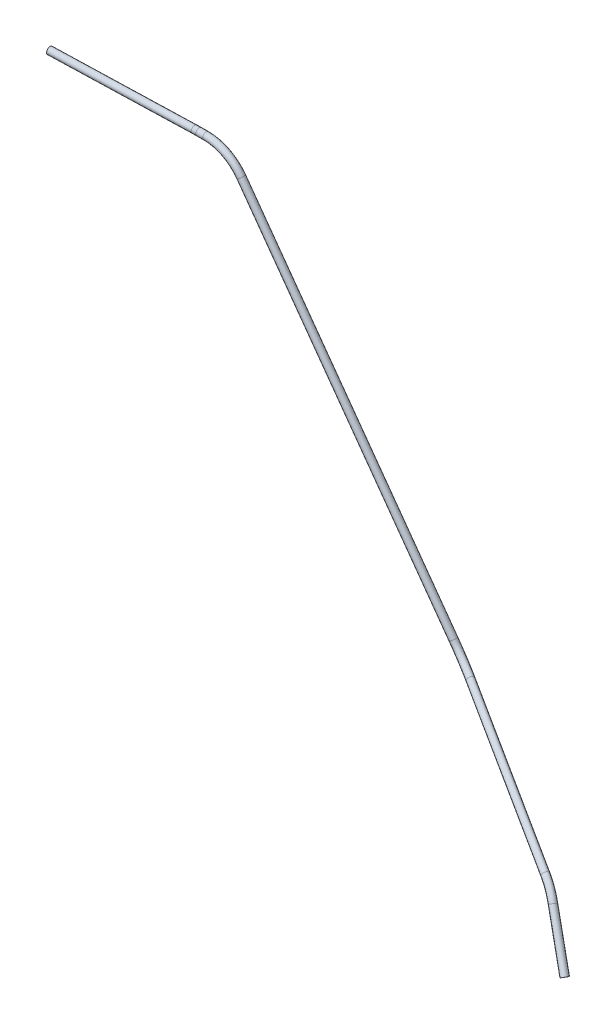
ISO-10303-21;
HEADER;
FILE_DESCRIPTION(('STEP AP214'),'2;1');
FILE_NAME('part.step','',(''),(''),'','','');
FILE_SCHEMA(('AUTOMOTIVE_DESIGN { 1 0 10303 214 1 1 1 1 }'));
ENDSEC;
DATA;
#1=APPLICATION_CONTEXT('core data for automotive mechanical design processes');
#2=APPLICATION_PROTOCOL_DEFINITION('international standard','automotive_design',2000,#1);
#3=PRODUCT_CONTEXT('',#1,'mechanical');
#4=PRODUCT('Part','Part','',(#3));
#5=PRODUCT_RELATED_PRODUCT_CATEGORY('part','',(#4));
#6=PRODUCT_DEFINITION_FORMATION('','',#4);
#7=PRODUCT_DEFINITION_CONTEXT('part definition',#1,'design');
#8=PRODUCT_DEFINITION('design','',#6,#7);
#9=PRODUCT_DEFINITION_SHAPE('','',#8);
#10=(LENGTH_UNIT() NAMED_UNIT(*) SI_UNIT(.MILLI.,.METRE.));
#11=(NAMED_UNIT(*) PLANE_ANGLE_UNIT() SI_UNIT($,.RADIAN.));
#12=(NAMED_UNIT(*) SI_UNIT($,.STERADIAN.) SOLID_ANGLE_UNIT());
#13=UNCERTAINTY_MEASURE_WITH_UNIT(LENGTH_MEASURE(1.E-05),#10,'distance_accuracy_value','');
#14=(GEOMETRIC_REPRESENTATION_CONTEXT(3) GLOBAL_UNCERTAINTY_ASSIGNED_CONTEXT((#13)) GLOBAL_UNIT_ASSIGNED_CONTEXT((#10,
#11,#12)) REPRESENTATION_CONTEXT('',''));
#15=CARTESIAN_POINT('',(0.,0.,0.));
#16=DIRECTION('',(0.,0.,1.));
#17=DIRECTION('',(1.,0.,0.));
#18=AXIS2_PLACEMENT_3D('',#15,#16,#17);
#19=CARTESIAN_POINT('',(101.002175739405,-599.755205594837,230.412469579618));
#20=DIRECTION('',(-0.517226492968256,0.803755924768077,-0.2940291964618));
#21=DIRECTION('',(-0.840927934536774,-0.541147123170507,0.));
#22=AXIS2_PLACEMENT_3D('',#19,#20,#21);
#23=CYLINDRICAL_SURFACE('',#22,3.25000000000002);
#24=CARTESIAN_POINT('',(74.8506963081246,-559.116516703021,215.546064652563));
#25=DIRECTION('',(-0.517226492968257,0.803755924768077,-0.2940291964618));
#26=DIRECTION('',(-0.840927934536774,-0.541147123170507,0.));
#27=AXIS2_PLACEMENT_3D('',#24,#25,#26);
#28=CIRCLE('',#27,3.25000000000002);
#29=CARTESIAN_POINT('',(77.2244176611122,-557.187270732627,216.644225353048));
#30=VERTEX_POINT('',#29);
#31=EDGE_CURVE('E56',#30,#30,#28,.T.);
#32=ORIENTED_EDGE('',*,*,#31,.F.);
#33=EDGE_LOOP('',(#32));
#34=FACE_BOUND('',#33,.T.);
#35=CARTESIAN_POINT('',(101.002175739405,-599.755205594837,230.412469579618));
#36=DIRECTION('',(-0.517226492968257,0.803755924768077,-0.2940291964618));
#37=DIRECTION('',(-0.840927934536774,-0.541147123170507,0.));
#38=AXIS2_PLACEMENT_3D('',#35,#36,#37);
#39=CIRCLE('',#38,3.25000000000002);
#40=CARTESIAN_POINT('',(98.2691599521602,-601.513933745141,230.412469579618));
#41=VERTEX_POINT('',#40);
#42=EDGE_CURVE('E53',#41,#41,#39,.T.);
#43=ORIENTED_EDGE('',*,*,#42,.T.);
#44=EDGE_LOOP('',(#43));
#45=FACE_BOUND('',#44,.T.);
#46=ADVANCED_FACE('F32',(#34,#45),#23,.T.);
#47=CARTESIAN_POINT('',(50.2022544561093,-579.149578738563,204.142893789225));
#48=DIRECTION('',(-0.446125480558223,0.0399832536048781,0.894076839554555));
#49=DIRECTION('',(0.894792360269454,0.,0.446482510299585));
#50=AXIS2_PLACEMENT_3D('',#47,#48,#49);
#51=TOROIDAL_SURFACE('',#50,33.7476157082322,3.25000000000002);
#52=CARTESIAN_POINT('',(59.5045303471715,-546.867351487626,207.340867046766));
#53=DIRECTION('',(-0.851465377197375,0.288721042396508,-0.437774909184625));
#54=DIRECTION('',(-0.415558546357129,-0.880672964780801,0.227433998456134));
#55=AXIS2_PLACEMENT_3D('',#52,#53,#54);
#56=CIRCLE('',#55,3.25000000000002);
#57=CARTESIAN_POINT('',(60.4003683496937,-543.75847293832,207.648841784207));
#58=VERTEX_POINT('',#57);
#59=EDGE_CURVE('E59',#58,#58,#56,.T.);
#60=CARTESIAN_POINT('',(50.2022544561093,-579.149578738563,204.142893789225));
#61=DIRECTION('',(-0.446125480558223,0.0399832536048781,0.894076839554555));
#62=DIRECTION('',(0.894792360269454,0.,0.446482510299585));
#63=AXIS2_PLACEMENT_3D('',#60,#61,#62);
#64=CIRCLE('',#63,36.9976157082322);
#65=EDGE_CURVE('',#30,#58,#64,.T.);
#66=ORIENTED_EDGE('',*,*,#31,.T.);
#67=ORIENTED_EDGE('',*,*,#59,.F.);
#68=ORIENTED_EDGE('',*,*,#65,.T.);
#69=ORIENTED_EDGE('',*,*,#65,.F.);
#70=EDGE_LOOP('',(#66,#68,#67,#69));
#71=FACE_BOUND('',#70,.T.);
#72=ADVANCED_FACE('F116',(#71),#51,.T.);
#73=CARTESIAN_POINT('',(59.5045303471715,-546.867351487626,207.340867046766));
#74=DIRECTION('',(-0.851465377197374,0.28872104239651,-0.437774909184624));
#75=DIRECTION('',(-0.457247591259512,0.,0.889339440420459));
#76=AXIS2_PLACEMENT_3D('',#73,#74,#75);
#77=CYLINDRICAL_SURFACE('',#76,3.25000000000002);
#78=CARTESIAN_POINT('',(-88.3740637470724,-496.723607562824,131.310132464177));
#79=DIRECTION('',(-0.851465377197374,0.28872104239651,-0.437774909184624));
#80=DIRECTION('',(-0.415558546357131,-0.8806729647808,0.227433998456132));
#81=AXIS2_PLACEMENT_3D('',#78,#79,#80);
#82=CIRCLE('',#81,3.25000000000002);
#83=CARTESIAN_POINT('',(-88.565195435367,-499.590430924969,129.791155016027));
#84=VERTEX_POINT('',#83);
#85=EDGE_CURVE('E62',#84,#84,#82,.T.);
#86=ORIENTED_EDGE('',*,*,#85,.F.);
#87=EDGE_LOOP('',(#86));
#88=FACE_BOUND('',#87,.T.);
#89=ORIENTED_EDGE('',*,*,#59,.T.);
#90=EDGE_LOOP('',(#89));
#91=FACE_BOUND('',#90,.T.);
#92=ADVANCED_FACE('F120',(#88,#91),#77,.T.);
#93=CARTESIAN_POINT('',(-86.0221075332519,-461.446134315525,150.001792019456));
#94=DIRECTION('',(0.521102796682491,0.372210476417677,-0.768056792519025));
#95=DIRECTION('',(-0.827515118449738,0.,-0.561443433247835));
#96=AXIS2_PLACEMENT_3D('',#93,#94,#95);
#97=TOROIDAL_SURFACE('',#96,39.992623740836,3.25000000000002);
#98=CARTESIAN_POINT('',(-111.81602779237,-478.149064418346,124.406953529584));
#99=DIRECTION('',(-0.558989730042736,0.82887128869644,0.0224247292392106));
#100=DIRECTION('',(-0.822927536688462,-0.557888880989418,0.107472163038782));
#101=AXIS2_PLACEMENT_3D('',#98,#99,#100);
#102=CIRCLE('',#101,3.25000000000002);
#103=CARTESIAN_POINT('',(-113.912170355693,-479.506427795801,122.32698934341));
#104=VERTEX_POINT('',#103);
#105=EDGE_CURVE('E65',#104,#104,#102,.T.);
#106=CARTESIAN_POINT('',(-86.0221075332519,-461.446134315525,150.001792019456));
#107=DIRECTION('',(0.521102796682491,0.372210476417677,-0.768056792519025));
#108=DIRECTION('',(-0.827515118449738,0.,-0.561443433247835));
#109=AXIS2_PLACEMENT_3D('',#106,#107,#108);
#110=CIRCLE('',#109,43.2426237408361);
#111=EDGE_CURVE('',#84,#104,#110,.T.);
#112=ORIENTED_EDGE('',*,*,#85,.T.);
#113=ORIENTED_EDGE('',*,*,#105,.F.);
#114=ORIENTED_EDGE('',*,*,#111,.T.);
#115=ORIENTED_EDGE('',*,*,#111,.F.);
#116=EDGE_LOOP('',(#112,#114,#113,#115));
#117=FACE_BOUND('',#116,.T.);
#118=ADVANCED_FACE('F124',(#117),#97,.T.);
#119=CARTESIAN_POINT('',(-111.81602779237,-478.149064418346,124.406953529584));
#120=DIRECTION('',(-0.558989730042733,0.828871288696442,0.0224247292392128));
#121=DIRECTION('',(-0.829079773953369,-0.55913033223161,0.));
#122=AXIS2_PLACEMENT_3D('',#119,#120,#121);
#123=CYLINDRICAL_SURFACE('',#122,3.25000000000002);
#124=CARTESIAN_POINT('',(-307.52724560114,-187.948009552625,132.258208807749));
#125=DIRECTION('',(-0.558989730042734,0.828871288696442,0.0224247292392128));
#126=DIRECTION('',(-0.822927536688464,-0.557888880989416,0.107472163038782));
#127=AXIS2_PLACEMENT_3D('',#124,#125,#126);
#128=CIRCLE('',#127,3.25000000000002);
#129=CARTESIAN_POINT('',(-304.832428220866,-186.131957436262,132.307341257563));
#130=VERTEX_POINT('',#129);
#131=EDGE_CURVE('E68',#130,#130,#128,.T.);
#132=ORIENTED_EDGE('',*,*,#131,.F.);
#133=EDGE_LOOP('',(#132));
#134=FACE_BOUND('',#133,.T.);
#135=ORIENTED_EDGE('',*,*,#105,.T.);
#136=EDGE_LOOP('',(#135));
#137=FACE_BOUND('',#136,.T.);
#138=ADVANCED_FACE('F128',(#134,#137),#123,.T.);
#139=CARTESIAN_POINT('',(-340.694228742976,-210.299420215559,131.653501733121));
#140=DIRECTION('',(0.,-0.0270446415259619,0.999634226787344));
#141=DIRECTION('',(0.,-0.999634226787345,-0.0270446415259619));
#142=AXIS2_PLACEMENT_3D('',#139,#140,#141);
#143=TOROIDAL_SURFACE('',#142,40.,3.25000000000002);
#144=CARTESIAN_POINT('',(-340.694228742975,-170.314051144065,132.73528739416));
#145=DIRECTION('',(-1.,0.,0.));
#146=DIRECTION('',(0.,-0.995416463560507,0.0956350567140182));
#147=AXIS2_PLACEMENT_3D('',#144,#145,#146);
#148=CIRCLE('',#147,3.25000000000002);
#149=CARTESIAN_POINT('',(-340.694228742975,-167.065239907006,132.823182479119));
#150=VERTEX_POINT('',#149);
#151=EDGE_CURVE('E71',#150,#150,#148,.T.);
#152=CARTESIAN_POINT('',(-340.694228742976,-210.299420215559,131.653501733121));
#153=DIRECTION('',(0.,-0.0270446415259619,0.999634226787344));
#154=DIRECTION('',(0.,-0.999634226787345,-0.0270446415259619));
#155=AXIS2_PLACEMENT_3D('',#152,#153,#154);
#156=CIRCLE('',#155,43.25);
#157=EDGE_CURVE('',#130,#150,#156,.T.);
#158=ORIENTED_EDGE('',*,*,#131,.T.);
#159=ORIENTED_EDGE('',*,*,#151,.F.);
#160=ORIENTED_EDGE('',*,*,#157,.T.);
#161=ORIENTED_EDGE('',*,*,#157,.F.);
#162=EDGE_LOOP('',(#158,#160,#159,#161));
#163=FACE_BOUND('',#162,.T.);
#164=ADVANCED_FACE('F90',(#163),#143,.T.);
#165=CARTESIAN_POINT('',(-340.694228742976,-170.314051144065,132.73528739416));
#166=DIRECTION('',(-1.,0.,0.));
#167=DIRECTION('',(0.,0.,1.));
#168=AXIS2_PLACEMENT_3D('',#165,#166,#167);
#169=CYLINDRICAL_SURFACE('',#168,3.25000000000002);
#170=CARTESIAN_POINT('',(-347.455121340827,-170.314051144065,132.73528739416));
#171=DIRECTION('',(-1.,0.,0.));
#172=DIRECTION('',(0.,-0.995416463560507,0.0956350567140182));
#173=AXIS2_PLACEMENT_3D('',#170,#171,#172);
#174=CIRCLE('',#173,3.25000000000002);
#175=CARTESIAN_POINT('',(-347.455121340827,-172.105659488579,130.023712291038));
#176=VERTEX_POINT('',#175);
#177=EDGE_CURVE('E73',#176,#176,#174,.T.);
#178=ORIENTED_EDGE('',*,*,#177,.F.);
#179=EDGE_LOOP('',(#178));
#180=FACE_BOUND('',#179,.T.);
#181=ORIENTED_EDGE('',*,*,#151,.T.);
#182=EDGE_LOOP('',(#181));
#183=FACE_BOUND('',#182,.T.);
#184=ADVANCED_FACE('F83',(#180,#183),#169,.T.);
#185=CARTESIAN_POINT('',(-347.455121340827,-148.263486903895,166.108519432579));
#186=DIRECTION('',(0.,0.834330800960476,-0.551264106004237));
#187=DIRECTION('',(0.,0.551264106004237,0.834330800960476));
#188=AXIS2_PLACEMENT_3D('',#185,#186,#187);
#189=TOROIDAL_SURFACE('',#188,40.,3.25000000000002);
#190=CARTESIAN_POINT('',(-351.918680922999,-170.176333137347,132.943721742777));
#191=DIRECTION('',(-0.993754445227919,0.0615150045665687,0.0931021310332114));
#192=DIRECTION('',(-0.0523292207200052,-0.993801905529421,0.0980786685519757));
#193=AXIS2_PLACEMENT_3D('',#190,#191,#192);
#194=CIRCLE('',#193,3.25000000000002);
#195=CARTESIAN_POINT('',(-352.281345139051,-171.956751893815,130.249081930481));
#196=VERTEX_POINT('',#195);
#197=EDGE_CURVE('E36',#196,#196,#194,.T.);
#198=CARTESIAN_POINT('',(-347.455121340827,-148.263486903895,166.108519432579));
#199=DIRECTION('',(0.,0.834330800960476,-0.551264106004237));
#200=DIRECTION('',(0.,0.551264106004237,0.834330800960476));
#201=AXIS2_PLACEMENT_3D('',#198,#199,#200);
#202=CIRCLE('',#201,43.25);
#203=EDGE_CURVE('',#176,#196,#202,.T.);
#204=ORIENTED_EDGE('',*,*,#177,.T.);
#205=ORIENTED_EDGE('',*,*,#197,.F.);
#206=ORIENTED_EDGE('',*,*,#203,.T.);
#207=ORIENTED_EDGE('',*,*,#203,.F.);
#208=EDGE_LOOP('',(#204,#206,#205,#207));
#209=FACE_BOUND('',#208,.T.);
#210=ADVANCED_FACE('F81',(#209),#189,.T.);
#211=CARTESIAN_POINT('',(-351.918680922999,-170.176333137347,132.943721742777));
#212=DIRECTION('',(-0.99375444522792,0.0615150045665667,0.093102131033206));
#213=DIRECTION('',(0.0932787862426744,0.,0.995640029346497));
#214=AXIS2_PLACEMENT_3D('',#211,#212,#213);
#215=CYLINDRICAL_SURFACE('',#214,3.25000000000002);
#216=CARTESIAN_POINT('',(-478.784997122078,-162.323103340182,144.829479286994));
#217=DIRECTION('',(-0.99375444522792,0.0615150045665667,0.093102131033206));
#218=DIRECTION('',(-0.0523292207200036,-0.993801905529421,0.0980786685519756));
#219=AXIS2_PLACEMENT_3D('',#216,#217,#218);
#220=CIRCLE('',#219,3.25000000000002);
#221=CARTESIAN_POINT('',(-478.955067089418,-165.552959533152,145.148234959788));
#222=VERTEX_POINT('',#221);
#223=EDGE_CURVE('E49',#222,#222,#220,.T.);
#224=ORIENTED_EDGE('',*,*,#223,.F.);
#225=EDGE_LOOP('',(#224));
#226=FACE_BOUND('',#225,.T.);
#227=ORIENTED_EDGE('',*,*,#197,.T.);
#228=EDGE_LOOP('',(#227));
#229=FACE_BOUND('',#228,.T.);
#230=ADVANCED_FACE('F34',(#226,#229),#215,.T.);
#231=CARTESIAN_POINT('',(101.002175739405,-599.755205594837,230.412469579618));
#232=DIRECTION('',(-0.517226492968257,0.803755924768077,-0.2940291964618));
#233=DIRECTION('',(-0.840927934536774,-0.541147123170507,0.));
#234=AXIS2_PLACEMENT_3D('',#231,#232,#233);
#235=PLANE('',#234);
#236=CARTESIAN_POINT('',(101.002175739405,-599.755205594837,230.412469579618));
#237=DIRECTION('',(-0.517226492968257,0.803755924768077,-0.2940291964618));
#238=DIRECTION('',(-0.840927934536774,-0.541147123170507,0.));
#239=AXIS2_PLACEMENT_3D('',#236,#237,#238);
#240=CIRCLE('',#239,1.75);
#241=CARTESIAN_POINT('',(99.5305518539653,-600.702213060385,230.412469579618));
#242=VERTEX_POINT('',#241);
#243=EDGE_CURVE('E52',#242,#242,#240,.F.);
#244=ORIENTED_EDGE('',*,*,#243,.F.);
#245=EDGE_LOOP('',(#244));
#246=FACE_BOUND('',#245,.T.);
#247=ORIENTED_EDGE('',*,*,#42,.F.);
#248=EDGE_LOOP('',(#247));
#249=FACE_BOUND('',#248,.T.);
#250=ADVANCED_FACE('F88',(#246,#249),#235,.F.);
#251=CARTESIAN_POINT('',(-478.784997122078,-162.323103340182,144.829479286994));
#252=DIRECTION('',(-0.99375444522792,0.0615150045665667,0.093102131033206));
#253=DIRECTION('',(-0.0523292207200036,-0.993801905529421,0.0980786685519756));
#254=AXIS2_PLACEMENT_3D('',#251,#252,#253);
#255=PLANE('',#254);
#256=CARTESIAN_POINT('',(-478.784997122078,-162.323103340182,144.829479286994));
#257=DIRECTION('',(-0.99375444522792,0.0615150045665667,0.093102131033206));
#258=DIRECTION('',(-0.0523292207200036,-0.993801905529421,0.0980786685519756));
#259=AXIS2_PLACEMENT_3D('',#256,#257,#258);
#260=CIRCLE('',#259,1.75);
#261=CARTESIAN_POINT('',(-478.876573258338,-164.062256674858,145.00111695696));
#262=VERTEX_POINT('',#261);
#263=EDGE_CURVE('E10',#262,#262,#260,.F.);
#264=ORIENTED_EDGE('',*,*,#263,.T.);
#265=EDGE_LOOP('',(#264));
#266=FACE_BOUND('',#265,.T.);
#267=ORIENTED_EDGE('',*,*,#223,.T.);
#268=EDGE_LOOP('',(#267));
#269=FACE_BOUND('',#268,.T.);
#270=ADVANCED_FACE('F107',(#266,#269),#255,.T.);
#271=CARTESIAN_POINT('',(101.002175739405,-599.755205594837,230.412469579618));
#272=DIRECTION('',(-0.517226492968256,0.803755924768077,-0.2940291964618));
#273=DIRECTION('',(-0.840927934536774,-0.541147123170507,0.));
#274=AXIS2_PLACEMENT_3D('',#271,#272,#273);
#275=CYLINDRICAL_SURFACE('',#274,1.75);
#276=CARTESIAN_POINT('',(74.8506963081246,-559.116516703021,215.546064652563));
#277=DIRECTION('',(-0.517226492968257,0.803755924768077,-0.2940291964618));
#278=DIRECTION('',(-0.840927934536774,-0.541147123170507,0.));
#279=AXIS2_PLACEMENT_3D('',#276,#277,#278);
#280=CIRCLE('',#279,1.75);
#281=CARTESIAN_POINT('',(76.1288539597333,-558.077691949732,216.137381952824));
#282=VERTEX_POINT('',#281);
#283=EDGE_CURVE('E281',#282,#282,#280,.F.);
#284=ORIENTED_EDGE('',*,*,#283,.F.);
#285=EDGE_LOOP('',(#284));
#286=FACE_BOUND('',#285,.T.);
#287=ORIENTED_EDGE('',*,*,#243,.T.);
#288=EDGE_LOOP('',(#287));
#289=FACE_BOUND('',#288,.T.);
#290=ADVANCED_FACE('F110',(#286,#289),#275,.F.);
#291=CARTESIAN_POINT('',(50.2022544561093,-579.149578738563,204.142893789225));
#292=DIRECTION('',(-0.446125480558223,0.0399832536048781,0.894076839554555));
#293=DIRECTION('',(0.894792360269454,0.,0.446482510299585));
#294=AXIS2_PLACEMENT_3D('',#291,#292,#293);
#295=TOROIDAL_SURFACE('',#294,33.7476157082322,1.75);
#296=CARTESIAN_POINT('',(59.5045303471715,-546.867351487626,207.340867046766));
#297=DIRECTION('',(-0.851465377197375,0.288721042396508,-0.437774909184625));
#298=DIRECTION('',(-0.415558546357129,-0.880672964780801,0.227433998456134));
#299=AXIS2_PLACEMENT_3D('',#296,#297,#298);
#300=CIRCLE('',#299,1.75);
#301=CARTESIAN_POINT('',(59.9869046562219,-545.193339961077,207.506699597695));
#302=VERTEX_POINT('',#301);
#303=EDGE_CURVE('E278',#302,#302,#300,.F.);
#304=CARTESIAN_POINT('',(50.2022544561093,-579.149578738563,204.142893789225));
#305=DIRECTION('',(-0.446125480558223,0.0399832536048781,0.894076839554555));
#306=DIRECTION('',(0.894792360269454,0.,0.446482510299585));
#307=AXIS2_PLACEMENT_3D('',#304,#305,#306);
#308=CIRCLE('',#307,35.4976157082322);
#309=EDGE_CURVE('',#282,#302,#308,.T.);
#310=ORIENTED_EDGE('',*,*,#283,.T.);
#311=ORIENTED_EDGE('',*,*,#303,.F.);
#312=ORIENTED_EDGE('',*,*,#309,.T.);
#313=ORIENTED_EDGE('',*,*,#309,.F.);
#314=EDGE_LOOP('',(#310,#312,#311,#313));
#315=FACE_BOUND('',#314,.T.);
#316=ADVANCED_FACE('F189',(#315),#295,.F.);
#317=CARTESIAN_POINT('',(59.5045303471715,-546.867351487626,207.340867046766));
#318=DIRECTION('',(-0.851465377197374,0.28872104239651,-0.437774909184624));
#319=DIRECTION('',(-0.457247591259512,0.,0.889339440420459));
#320=AXIS2_PLACEMENT_3D('',#317,#318,#319);
#321=CYLINDRICAL_SURFACE('',#320,1.75);
#322=CARTESIAN_POINT('',(-88.3740637470724,-496.723607562824,131.310132464177));
#323=DIRECTION('',(-0.851465377197374,0.28872104239651,-0.437774909184624));
#324=DIRECTION('',(-0.415558546357131,-0.8806729647808,0.227433998456132));
#325=AXIS2_PLACEMENT_3D('',#322,#323,#324);
#326=CIRCLE('',#325,1.75);
#327=CARTESIAN_POINT('',(-88.4769808100003,-498.267281680902,130.492221530558));
#328=VERTEX_POINT('',#327);
#329=EDGE_CURVE('E275',#328,#328,#326,.F.);
#330=ORIENTED_EDGE('',*,*,#329,.F.);
#331=EDGE_LOOP('',(#330));
#332=FACE_BOUND('',#331,.T.);
#333=ORIENTED_EDGE('',*,*,#303,.T.);
#334=EDGE_LOOP('',(#333));
#335=FACE_BOUND('',#334,.T.);
#336=ADVANCED_FACE('F199',(#332,#335),#321,.F.);
#337=CARTESIAN_POINT('',(-86.0221075332519,-461.446134315525,150.001792019456));
#338=DIRECTION('',(0.521102796682491,0.372210476417677,-0.768056792519025));
#339=DIRECTION('',(-0.827515118449738,0.,-0.561443433247835));
#340=AXIS2_PLACEMENT_3D('',#337,#338,#339);
#341=TOROIDAL_SURFACE('',#340,39.992623740836,1.75);
#342=CARTESIAN_POINT('',(-111.81602779237,-478.149064418346,124.406953529584));
#343=DIRECTION('',(-0.558989730042736,0.82887128869644,0.0224247292392106));
#344=DIRECTION('',(-0.822927536688462,-0.557888880989418,0.107472163038782));
#345=AXIS2_PLACEMENT_3D('',#342,#343,#344);
#346=CIRCLE('',#345,1.75);
#347=CARTESIAN_POINT('',(-112.944719941851,-478.879952390822,123.286972813952));
#348=VERTEX_POINT('',#347);
#349=EDGE_CURVE('E270',#348,#348,#346,.F.);
#350=CARTESIAN_POINT('',(-86.0221075332519,-461.446134315525,150.001792019456));
#351=DIRECTION('',(0.521102796682491,0.372210476417677,-0.768056792519025));
#352=DIRECTION('',(-0.827515118449738,0.,-0.561443433247835));
#353=AXIS2_PLACEMENT_3D('',#350,#351,#352);
#354=CIRCLE('',#353,41.742623740836);
#355=EDGE_CURVE('',#328,#348,#354,.T.);
#356=ORIENTED_EDGE('',*,*,#329,.T.);
#357=ORIENTED_EDGE('',*,*,#349,.F.);
#358=ORIENTED_EDGE('',*,*,#355,.T.);
#359=ORIENTED_EDGE('',*,*,#355,.F.);
#360=EDGE_LOOP('',(#356,#358,#357,#359));
#361=FACE_BOUND('',#360,.T.);
#362=ADVANCED_FACE('F209',(#361),#341,.F.);
#363=CARTESIAN_POINT('',(-111.81602779237,-478.149064418346,124.406953529584));
#364=DIRECTION('',(-0.558989730042733,0.828871288696442,0.0224247292392128));
#365=DIRECTION('',(-0.829079773953369,-0.55913033223161,0.));
#366=AXIS2_PLACEMENT_3D('',#363,#364,#365);
#367=CYLINDRICAL_SURFACE('',#366,1.75);
#368=CARTESIAN_POINT('',(-307.52724560114,-187.948009552625,132.258208807749));
#369=DIRECTION('',(-0.558989730042734,0.828871288696442,0.0224247292392128));
#370=DIRECTION('',(-0.822927536688464,-0.557888880989416,0.107472163038782));
#371=AXIS2_PLACEMENT_3D('',#368,#369,#370);
#372=CIRCLE('',#371,1.75);
#373=CARTESIAN_POINT('',(-306.076190088685,-186.970135336122,132.284664742264));
#374=VERTEX_POINT('',#373);
#375=EDGE_CURVE('E267',#374,#374,#372,.F.);
#376=ORIENTED_EDGE('',*,*,#375,.F.);
#377=EDGE_LOOP('',(#376));
#378=FACE_BOUND('',#377,.T.);
#379=ORIENTED_EDGE('',*,*,#349,.T.);
#380=EDGE_LOOP('',(#379));
#381=FACE_BOUND('',#380,.T.);
#382=ADVANCED_FACE('F219',(#378,#381),#367,.F.);
#383=CARTESIAN_POINT('',(-340.694228742976,-210.299420215559,131.653501733121));
#384=DIRECTION('',(0.,-0.0270446415259619,0.999634226787344));
#385=DIRECTION('',(0.,-0.999634226787345,-0.0270446415259619));
#386=AXIS2_PLACEMENT_3D('',#383,#384,#385);
#387=TOROIDAL_SURFACE('',#386,40.,1.75);
#388=CARTESIAN_POINT('',(-340.694228742975,-170.314051144065,132.73528739416));
#389=DIRECTION('',(-1.,0.,0.));
#390=DIRECTION('',(0.,-0.995416463560507,0.0956350567140182));
#391=AXIS2_PLACEMENT_3D('',#388,#389,#390);
#392=CIRCLE('',#391,1.75);
#393=CARTESIAN_POINT('',(-340.694228742975,-168.564691247187,132.78261551683));
#394=VERTEX_POINT('',#393);
#395=EDGE_CURVE('E266',#394,#394,#392,.F.);
#396=CARTESIAN_POINT('',(-340.694228742976,-210.299420215559,131.653501733121));
#397=DIRECTION('',(0.,-0.0270446415259619,0.999634226787344));
#398=DIRECTION('',(0.,-0.999634226787345,-0.0270446415259619));
#399=AXIS2_PLACEMENT_3D('',#396,#397,#398);
#400=CIRCLE('',#399,41.75);
#401=EDGE_CURVE('',#374,#394,#400,.T.);
#402=ORIENTED_EDGE('',*,*,#375,.T.);
#403=ORIENTED_EDGE('',*,*,#395,.F.);
#404=ORIENTED_EDGE('',*,*,#401,.T.);
#405=ORIENTED_EDGE('',*,*,#401,.F.);
#406=EDGE_LOOP('',(#402,#404,#403,#405));
#407=FACE_BOUND('',#406,.T.);
#408=ADVANCED_FACE('F229',(#407),#387,.F.);
#409=CARTESIAN_POINT('',(-340.694228742976,-170.314051144065,132.73528739416));
#410=DIRECTION('',(-1.,0.,0.));
#411=DIRECTION('',(0.,0.,1.));
#412=AXIS2_PLACEMENT_3D('',#409,#410,#411);
#413=CYLINDRICAL_SURFACE('',#412,1.75);
#414=CARTESIAN_POINT('',(-347.455121340827,-170.314051144065,132.73528739416));
#415=DIRECTION('',(-1.,0.,0.));
#416=DIRECTION('',(0.,-0.995416463560507,0.0956350567140182));
#417=AXIS2_PLACEMENT_3D('',#414,#415,#416);
#418=CIRCLE('',#417,1.75);
#419=CARTESIAN_POINT('',(-347.455121340827,-171.278763329572,131.275208492479));
#420=VERTEX_POINT('',#419);
#421=EDGE_CURVE('E45',#420,#420,#418,.F.);
#422=ORIENTED_EDGE('',*,*,#421,.F.);
#423=EDGE_LOOP('',(#422));
#424=FACE_BOUND('',#423,.T.);
#425=ORIENTED_EDGE('',*,*,#395,.T.);
#426=EDGE_LOOP('',(#425));
#427=FACE_BOUND('',#426,.T.);
#428=ADVANCED_FACE('F101',(#424,#427),#413,.F.);
#429=CARTESIAN_POINT('',(-347.455121340827,-148.263486903895,166.108519432579));
#430=DIRECTION('',(0.,0.834330800960476,-0.551264106004237));
#431=DIRECTION('',(0.,0.551264106004237,0.834330800960476));
#432=AXIS2_PLACEMENT_3D('',#429,#430,#431);
#433=TOROIDAL_SURFACE('',#432,40.,1.75);
#434=CARTESIAN_POINT('',(-351.918680922999,-170.176333137347,132.943721742777));
#435=DIRECTION('',(-0.993754445227919,0.0615150045665687,0.0931021310332114));
#436=DIRECTION('',(-0.0523292207200052,-0.993801905529421,0.0980786685519757));
#437=AXIS2_PLACEMENT_3D('',#434,#435,#436);
#438=CIRCLE('',#437,1.75);
#439=CARTESIAN_POINT('',(-352.113961654719,-171.135020160061,131.492761843848));
#440=VERTEX_POINT('',#439);
#441=EDGE_CURVE('E40',#440,#440,#438,.F.);
#442=CARTESIAN_POINT('',(-347.455121340827,-148.263486903895,166.108519432579));
#443=DIRECTION('',(0.,0.834330800960476,-0.551264106004237));
#444=DIRECTION('',(0.,0.551264106004237,0.834330800960476));
#445=AXIS2_PLACEMENT_3D('',#442,#443,#444);
#446=CIRCLE('',#445,41.75);
#447=EDGE_CURVE('',#420,#440,#446,.T.);
#448=ORIENTED_EDGE('',*,*,#421,.T.);
#449=ORIENTED_EDGE('',*,*,#441,.F.);
#450=ORIENTED_EDGE('',*,*,#447,.T.);
#451=ORIENTED_EDGE('',*,*,#447,.F.);
#452=EDGE_LOOP('',(#448,#450,#449,#451));
#453=FACE_BOUND('',#452,.T.);
#454=ADVANCED_FACE('F95',(#453),#433,.F.);
#455=CARTESIAN_POINT('',(-351.918680922999,-170.176333137347,132.943721742777));
#456=DIRECTION('',(-0.99375444522792,0.0615150045665667,0.093102131033206));
#457=DIRECTION('',(0.0932787862426744,0.,0.995640029346497));
#458=AXIS2_PLACEMENT_3D('',#455,#456,#457);
#459=CYLINDRICAL_SURFACE('',#458,1.75);
#460=ORIENTED_EDGE('',*,*,#263,.F.);
#461=EDGE_LOOP('',(#460));
#462=FACE_BOUND('',#461,.T.);
#463=ORIENTED_EDGE('',*,*,#441,.T.);
#464=EDGE_LOOP('',(#463));
#465=FACE_BOUND('',#464,.T.);
#466=ADVANCED_FACE('F93',(#462,#465),#459,.F.);
#467=CLOSED_SHELL('',(#46,#72,#92,#118,#138,#164,#184,#210,#230,#250,#270,#290,#316,#336,#362,
#382,#408,#428,#454,#466));
#468=MANIFOLD_SOLID_BREP('B2',#467);
#469=ADVANCED_BREP_SHAPE_REPRESENTATION('',(#18,#468),#14);
#470=SHAPE_DEFINITION_REPRESENTATION(#9,#469);
ENDSEC;
END-ISO-10303-21;
